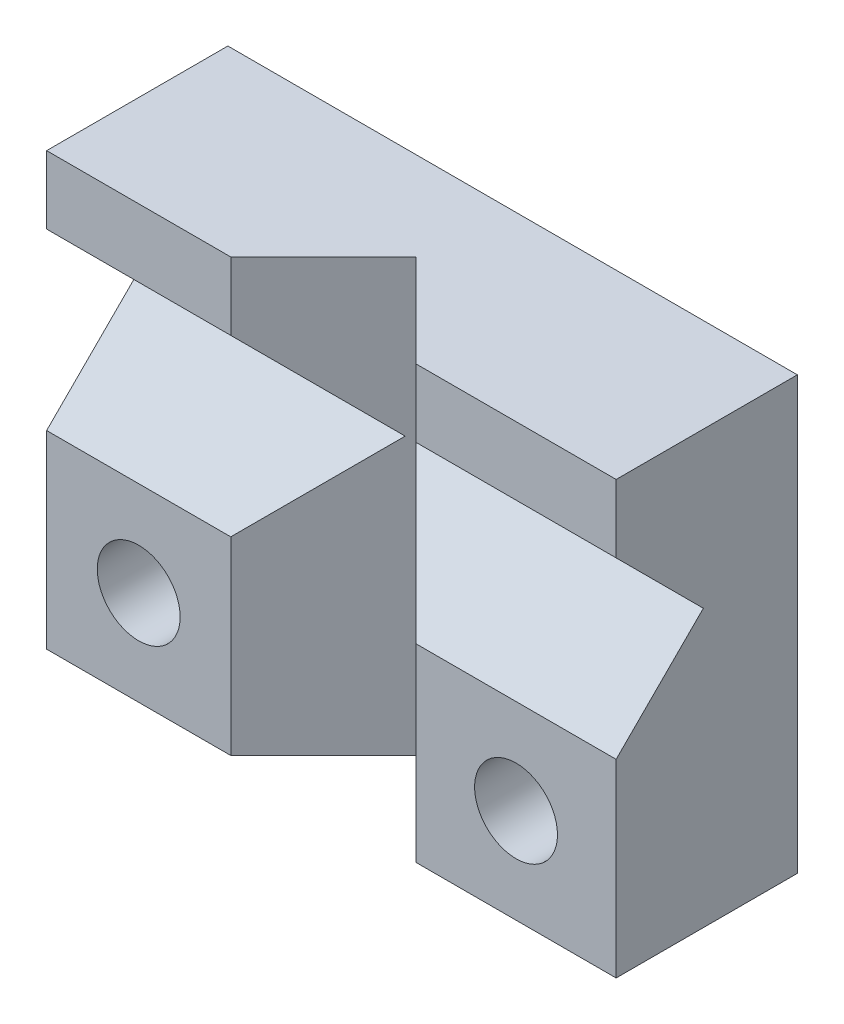
ISO-10303-21;
HEADER;
FILE_DESCRIPTION(('STEP AP214'),'2;1');
FILE_NAME('part.step','',(''),(''),'','','');
FILE_SCHEMA(('AUTOMOTIVE_DESIGN { 1 0 10303 214 1 1 1 1 }'));
ENDSEC;
DATA;
#1=APPLICATION_CONTEXT('core data for automotive mechanical design processes');
#2=APPLICATION_PROTOCOL_DEFINITION('international standard','automotive_design',2000,#1);
#3=PRODUCT_CONTEXT('',#1,'mechanical');
#4=PRODUCT('Part','Part','',(#3));
#5=PRODUCT_RELATED_PRODUCT_CATEGORY('part','',(#4));
#6=PRODUCT_DEFINITION_FORMATION('','',#4);
#7=PRODUCT_DEFINITION_CONTEXT('part definition',#1,'design');
#8=PRODUCT_DEFINITION('design','',#6,#7);
#9=PRODUCT_DEFINITION_SHAPE('','',#8);
#10=(LENGTH_UNIT() NAMED_UNIT(*) SI_UNIT(.MILLI.,.METRE.));
#11=(NAMED_UNIT(*) PLANE_ANGLE_UNIT() SI_UNIT($,.RADIAN.));
#12=(NAMED_UNIT(*) SI_UNIT($,.STERADIAN.) SOLID_ANGLE_UNIT());
#13=UNCERTAINTY_MEASURE_WITH_UNIT(LENGTH_MEASURE(1.E-05),#10,'distance_accuracy_value','');
#14=(GEOMETRIC_REPRESENTATION_CONTEXT(3) GLOBAL_UNCERTAINTY_ASSIGNED_CONTEXT((#13)) GLOBAL_UNIT_ASSIGNED_CONTEXT((#10,
#11,#12)) REPRESENTATION_CONTEXT('',''));
#15=CARTESIAN_POINT('',(0.,0.,0.));
#16=DIRECTION('',(0.,0.,1.));
#17=DIRECTION('',(1.,0.,0.));
#18=AXIS2_PLACEMENT_3D('',#15,#16,#17);
#19=CARTESIAN_POINT('',(0.,0.,4.));
#20=DIRECTION('',(0.,0.,1.));
#21=DIRECTION('',(1.,0.,0.));
#22=AXIS2_PLACEMENT_3D('',#19,#20,#21);
#23=PLANE('',#22);
#24=DIRECTION('',(0.,1.,0.));
#25=VECTOR('',#24,1.);
#26=CARTESIAN_POINT('',(-2.22099999999996,-4.76600000000002,4.));
#27=LINE('',#26,#25);
#28=CARTESIAN_POINT('',(-2.22099999999996,3.26499999999999,4.));
#29=VERTEX_POINT('',#28);
#30=CARTESIAN_POINT('',(-2.22099999999996,4.76499999999999,4.));
#31=VERTEX_POINT('',#30);
#32=EDGE_CURVE('E236',#29,#31,#27,.T.);
#33=ORIENTED_EDGE('',*,*,#32,.T.);
#34=DIRECTION('',(-1.,0.,0.));
#35=VECTOR('',#34,1.);
#36=CARTESIAN_POINT('',(-6.28499999999996,4.76499999999999,4.));
#37=LINE('',#36,#35);
#38=CARTESIAN_POINT('',(-6.28499999999996,4.76499999999999,4.));
#39=VERTEX_POINT('',#38);
#40=EDGE_CURVE('E163',#31,#39,#37,.T.);
#41=ORIENTED_EDGE('',*,*,#40,.T.);
#42=DIRECTION('',(0.,-1.,0.));
#43=VECTOR('',#42,1.);
#44=CARTESIAN_POINT('',(-6.28499999999996,4.76499999999999,4.));
#45=LINE('',#44,#43);
#46=CARTESIAN_POINT('',(-6.28499999999996,3.26499999999999,4.));
#47=VERTEX_POINT('',#46);
#48=EDGE_CURVE('E169',#39,#47,#45,.T.);
#49=ORIENTED_EDGE('',*,*,#48,.T.);
#50=DIRECTION('',(-1.,0.,0.));
#51=VECTOR('',#50,1.);
#52=CARTESIAN_POINT('',(6.28600000000007,3.26499999999999,4.));
#53=LINE('',#52,#51);
#54=EDGE_CURVE('E226',#29,#47,#53,.T.);
#55=ORIENTED_EDGE('',*,*,#54,.F.);
#56=EDGE_LOOP('',(#33,#41,#49,#55));
#57=FACE_BOUND('',#56,.T.);
#58=ADVANCED_FACE('F35',(#57),#23,.T.);
#59=CARTESIAN_POINT('',(-4.25299999999996,-2.67500000000002,4.));
#60=DIRECTION('',(0.,0.,1.));
#61=DIRECTION('',(1.,0.,0.));
#62=AXIS2_PLACEMENT_3D('',#59,#60,#61);
#63=CIRCLE('',#62,0.914399999999999);
#64=CARTESIAN_POINT('',(-3.33859999999996,-2.67500000000002,4.));
#65=VERTEX_POINT('',#64);
#66=EDGE_CURVE('E410',#65,#65,#63,.T.);
#67=ORIENTED_EDGE('',*,*,#66,.F.);
#68=EDGE_LOOP('',(#67));
#69=FACE_BOUND('',#68,.T.);
#70=CARTESIAN_POINT('',(-2.22099999999996,-4.76500000000002,4.));
#71=VERTEX_POINT('',#70);
#72=CARTESIAN_POINT('',(-2.22099999999996,-0.58500000000002,4.));
#73=VERTEX_POINT('',#72);
#74=EDGE_CURVE('E136',#71,#73,#27,.T.);
#75=ORIENTED_EDGE('',*,*,#74,.T.);
#76=DIRECTION('',(-1.,0.,0.));
#77=VECTOR('',#76,1.);
#78=CARTESIAN_POINT('',(6.28600000000007,-0.58500000000002,4.));
#79=LINE('',#78,#77);
#80=CARTESIAN_POINT('',(-6.28499999999996,-0.58500000000002,4.));
#81=VERTEX_POINT('',#80);
#82=EDGE_CURVE('E58',#73,#81,#79,.T.);
#83=ORIENTED_EDGE('',*,*,#82,.T.);
#84=CARTESIAN_POINT('',(-6.28499999999996,-4.76500000000002,4.));
#85=VERTEX_POINT('',#84);
#86=EDGE_CURVE('E168',#81,#85,#45,.T.);
#87=ORIENTED_EDGE('',*,*,#86,.T.);
#88=DIRECTION('',(1.,0.,0.));
#89=VECTOR('',#88,1.);
#90=CARTESIAN_POINT('',(-6.28499999999996,-4.76500000000002,4.));
#91=LINE('',#90,#89);
#92=EDGE_CURVE('E173',#85,#71,#91,.T.);
#93=ORIENTED_EDGE('',*,*,#92,.T.);
#94=EDGE_LOOP('',(#75,#83,#87,#93));
#95=FACE_BOUND('',#94,.T.);
#96=ADVANCED_FACE('F259',(#69,#95),#23,.T.);
#97=CARTESIAN_POINT('',(6.28600000000007,3.26499999999999,4.));
#98=DIRECTION('',(0.,0.707106781186547,-0.707106781186547));
#99=DIRECTION('',(0.,0.707106781186548,0.707106781186548));
#100=AXIS2_PLACEMENT_3D('',#97,#98,#99);
#101=PLANE('',#100);
#102=DIRECTION('',(-1.,0.,0.));
#103=VECTOR('',#102,1.);
#104=CARTESIAN_POINT('',(6.28600000000007,1.33999999999999,2.07499999999999));
#105=LINE('',#104,#103);
#106=CARTESIAN_POINT('',(-0.295999999999952,1.33999999999999,2.075));
#107=VERTEX_POINT('',#106);
#108=CARTESIAN_POINT('',(-6.28499999999996,1.33999999999999,2.07499999999999));
#109=VERTEX_POINT('',#108);
#110=EDGE_CURVE('E151',#107,#109,#105,.T.);
#111=ORIENTED_EDGE('',*,*,#110,.F.);
#112=DIRECTION('',(0.577350269189626,-0.577350269189626,-0.577350269189626));
#113=VECTOR('',#112,1.);
#114=CARTESIAN_POINT('',(0.456000000000048,0.58799999999999,1.323));
#115=LINE('',#114,#113);
#116=EDGE_CURVE('E232',#29,#107,#115,.T.);
#117=ORIENTED_EDGE('',*,*,#116,.F.);
#118=ORIENTED_EDGE('',*,*,#54,.T.);
#119=DIRECTION('',(0.,-0.707106781186547,-0.707106781186548));
#120=VECTOR('',#119,1.);
#121=CARTESIAN_POINT('',(-6.28499999999996,3.26499999999999,4.));
#122=LINE('',#121,#120);
#123=EDGE_CURVE('E221',#47,#109,#122,.T.);
#124=ORIENTED_EDGE('',*,*,#123,.T.);
#125=EDGE_LOOP('',(#111,#117,#118,#124));
#126=FACE_BOUND('',#125,.T.);
#127=ADVANCED_FACE('F231',(#126),#101,.F.);
#128=CARTESIAN_POINT('',(6.28600000000007,1.33999999999999,2.07499999999999));
#129=DIRECTION('',(0.,-0.707106781186547,-0.707106781186547));
#130=DIRECTION('',(0.,0.707106781186548,-0.707106781186548));
#131=AXIS2_PLACEMENT_3D('',#128,#129,#130);
#132=PLANE('',#131);
#133=ORIENTED_EDGE('',*,*,#82,.F.);
#134=DIRECTION('',(-0.577350269189626,-0.577350269189626,0.577350269189626));
#135=VECTOR('',#134,1.);
#136=CARTESIAN_POINT('',(-3.61466666666662,-1.97866666666669,5.39366666666667));
#137=LINE('',#136,#135);
#138=EDGE_CURVE('E400',#107,#73,#137,.T.);
#139=ORIENTED_EDGE('',*,*,#138,.F.);
#140=ORIENTED_EDGE('',*,*,#110,.T.);
#141=DIRECTION('',(0.,-0.707106781186547,0.707106781186548));
#142=VECTOR('',#141,1.);
#143=CARTESIAN_POINT('',(-6.28499999999996,1.33999999999999,2.07499999999999));
#144=LINE('',#143,#142);
#145=EDGE_CURVE('E155',#109,#81,#144,.T.);
#146=ORIENTED_EDGE('',*,*,#145,.T.);
#147=EDGE_LOOP('',(#133,#139,#140,#146));
#148=FACE_BOUND('',#147,.T.);
#149=ADVANCED_FACE('F257',(#148),#132,.F.);
#150=DIRECTION('',(0.,1.,0.));
#151=VECTOR('',#150,1.);
#152=CARTESIAN_POINT('',(1.86631269327047,-4.76600000000002,4.));
#153=LINE('',#152,#151);
#154=CARTESIAN_POINT('',(1.86631269327047,3.26499999999999,4.));
#155=VERTEX_POINT('',#154);
#156=CARTESIAN_POINT('',(1.86631269327047,4.76499999999999,4.));
#157=VERTEX_POINT('',#156);
#158=EDGE_CURVE('E245',#155,#157,#153,.T.);
#159=ORIENTED_EDGE('',*,*,#158,.F.);
#160=CARTESIAN_POINT('',(6.28500000000007,3.26499999999999,4.));
#161=VERTEX_POINT('',#160);
#162=EDGE_CURVE('E144',#161,#155,#53,.T.);
#163=ORIENTED_EDGE('',*,*,#162,.F.);
#164=DIRECTION('',(0.,1.,0.));
#165=VECTOR('',#164,1.);
#166=CARTESIAN_POINT('',(6.28500000000007,4.76499999999999,4.));
#167=LINE('',#166,#165);
#168=CARTESIAN_POINT('',(6.28500000000007,4.76499999999999,4.));
#169=VERTEX_POINT('',#168);
#170=EDGE_CURVE('E164',#161,#169,#167,.T.);
#171=ORIENTED_EDGE('',*,*,#170,.T.);
#172=EDGE_CURVE('E165',#169,#157,#37,.T.);
#173=ORIENTED_EDGE('',*,*,#172,.T.);
#174=EDGE_LOOP('',(#159,#163,#171,#173));
#175=FACE_BOUND('',#174,.T.);
#176=ADVANCED_FACE('F255',(#175),#23,.T.);
#177=CARTESIAN_POINT('',(6.28500000000007,4.76499999999999,4.));
#178=DIRECTION('',(-1.,0.,0.));
#179=DIRECTION('',(0.,0.,1.));
#180=AXIS2_PLACEMENT_3D('',#177,#178,#179);
#181=PLANE('',#180);
#182=ORIENTED_EDGE('',*,*,#170,.F.);
#183=DIRECTION('',(0.,0.707106781186548,0.707106781186548));
#184=VECTOR('',#183,1.);
#185=CARTESIAN_POINT('',(6.28500000000007,3.26499999999999,4.));
#186=LINE('',#185,#184);
#187=CARTESIAN_POINT('',(6.28500000000007,1.33999999999999,2.07499999999999));
#188=VERTEX_POINT('',#187);
#189=EDGE_CURVE('E219',#188,#161,#186,.T.);
#190=ORIENTED_EDGE('',*,*,#189,.F.);
#191=DIRECTION('',(0.,0.707106781186548,-0.707106781186548));
#192=VECTOR('',#191,1.);
#193=CARTESIAN_POINT('',(6.28500000000007,1.33999999999999,2.07499999999999));
#194=LINE('',#193,#192);
#195=CARTESIAN_POINT('',(6.28500000000007,-0.58500000000002,4.));
#196=VERTEX_POINT('',#195);
#197=EDGE_CURVE('E149',#196,#188,#194,.T.);
#198=ORIENTED_EDGE('',*,*,#197,.F.);
#199=CARTESIAN_POINT('',(6.28500000000007,-4.76500000000002,4.));
#200=VERTEX_POINT('',#199);
#201=EDGE_CURVE('E160',#200,#196,#167,.T.);
#202=ORIENTED_EDGE('',*,*,#201,.F.);
#203=DIRECTION('',(0.,0.,-1.));
#204=VECTOR('',#203,1.);
#205=CARTESIAN_POINT('',(6.28500000000007,-4.76500000000002,4.));
#206=LINE('',#205,#204);
#207=CARTESIAN_POINT('',(6.28500000000007,-4.76500000000002,0.));
#208=VERTEX_POINT('',#207);
#209=EDGE_CURVE('E176',#200,#208,#206,.T.);
#210=ORIENTED_EDGE('',*,*,#209,.T.);
#211=DIRECTION('',(0.,1.,0.));
#212=VECTOR('',#211,1.);
#213=CARTESIAN_POINT('',(6.28500000000007,4.76499999999999,0.));
#214=LINE('',#213,#212);
#215=CARTESIAN_POINT('',(6.28500000000007,4.76499999999999,0.));
#216=VERTEX_POINT('',#215);
#217=EDGE_CURVE('E159',#208,#216,#214,.T.);
#218=ORIENTED_EDGE('',*,*,#217,.T.);
#219=DIRECTION('',(0.,0.,-1.));
#220=VECTOR('',#219,1.);
#221=CARTESIAN_POINT('',(6.28500000000007,4.76499999999999,4.));
#222=LINE('',#221,#220);
#223=EDGE_CURVE('E11',#169,#216,#222,.T.);
#224=ORIENTED_EDGE('',*,*,#223,.F.);
#225=EDGE_LOOP('',(#182,#190,#198,#202,#210,#218,#224));
#226=FACE_BOUND('',#225,.T.);
#227=ADVANCED_FACE('F37',(#226),#181,.F.);
#228=CARTESIAN_POINT('',(-6.28499999999996,4.76499999999999,4.));
#229=DIRECTION('',(0.,-1.,0.));
#230=DIRECTION('',(0.,0.,-1.));
#231=AXIS2_PLACEMENT_3D('',#228,#229,#230);
#232=PLANE('',#231);
#233=ORIENTED_EDGE('',*,*,#40,.F.);
#234=DIRECTION('',(-0.707106781186547,0.,0.707106781186547));
#235=VECTOR('',#234,1.);
#236=CARTESIAN_POINT('',(-2.22099999999996,4.76499999999999,4.));
#237=LINE('',#236,#235);
#238=CARTESIAN_POINT('',(-0.177343653364743,4.76499999999999,1.95634365336479));
#239=VERTEX_POINT('',#238);
#240=EDGE_CURVE('E240',#239,#31,#237,.T.);
#241=ORIENTED_EDGE('',*,*,#240,.F.);
#242=DIRECTION('',(-0.707106781186548,0.,-0.707106781186548));
#243=VECTOR('',#242,1.);
#244=CARTESIAN_POINT('',(-0.177343653364743,4.76499999999999,1.95634365336479));
#245=LINE('',#244,#243);
#246=EDGE_CURVE('E243',#157,#239,#245,.T.);
#247=ORIENTED_EDGE('',*,*,#246,.F.);
#248=ORIENTED_EDGE('',*,*,#172,.F.);
#249=ORIENTED_EDGE('',*,*,#223,.T.);
#250=DIRECTION('',(-1.,0.,0.));
#251=VECTOR('',#250,1.);
#252=CARTESIAN_POINT('',(-6.28499999999996,4.76499999999999,0.));
#253=LINE('',#252,#251);
#254=CARTESIAN_POINT('',(-6.28499999999996,4.76499999999999,0.));
#255=VERTEX_POINT('',#254);
#256=EDGE_CURVE('E179',#216,#255,#253,.T.);
#257=ORIENTED_EDGE('',*,*,#256,.T.);
#258=DIRECTION('',(0.,0.,-1.));
#259=VECTOR('',#258,1.);
#260=CARTESIAN_POINT('',(-6.28499999999996,4.76499999999999,4.));
#261=LINE('',#260,#259);
#262=EDGE_CURVE('E43',#39,#255,#261,.T.);
#263=ORIENTED_EDGE('',*,*,#262,.F.);
#264=EDGE_LOOP('',(#233,#241,#247,#248,#249,#257,#263));
#265=FACE_BOUND('',#264,.T.);
#266=ADVANCED_FACE('F238',(#265),#232,.F.);
#267=CARTESIAN_POINT('',(-6.28499999999996,4.76499999999999,4.));
#268=DIRECTION('',(1.,0.,0.));
#269=DIRECTION('',(0.,0.,-1.));
#270=AXIS2_PLACEMENT_3D('',#267,#268,#269);
#271=PLANE('',#270);
#272=ORIENTED_EDGE('',*,*,#145,.F.);
#273=ORIENTED_EDGE('',*,*,#123,.F.);
#274=ORIENTED_EDGE('',*,*,#48,.F.);
#275=ORIENTED_EDGE('',*,*,#262,.T.);
#276=DIRECTION('',(0.,-1.,0.));
#277=VECTOR('',#276,1.);
#278=CARTESIAN_POINT('',(-6.28499999999996,4.76499999999999,0.));
#279=LINE('',#278,#277);
#280=CARTESIAN_POINT('',(-6.28499999999996,-4.76500000000002,0.));
#281=VERTEX_POINT('',#280);
#282=EDGE_CURVE('E181',#255,#281,#279,.T.);
#283=ORIENTED_EDGE('',*,*,#282,.T.);
#284=DIRECTION('',(0.,0.,-1.));
#285=VECTOR('',#284,1.);
#286=CARTESIAN_POINT('',(-6.28499999999996,-4.76500000000002,4.));
#287=LINE('',#286,#285);
#288=EDGE_CURVE('E187',#85,#281,#287,.T.);
#289=ORIENTED_EDGE('',*,*,#288,.F.);
#290=ORIENTED_EDGE('',*,*,#86,.F.);
#291=EDGE_LOOP('',(#272,#273,#274,#275,#283,#289,#290));
#292=FACE_BOUND('',#291,.T.);
#293=ADVANCED_FACE('F195',(#292),#271,.F.);
#294=CARTESIAN_POINT('',(-6.28499999999996,-4.76500000000002,4.));
#295=DIRECTION('',(0.,1.,0.));
#296=DIRECTION('',(0.,0.,1.));
#297=AXIS2_PLACEMENT_3D('',#294,#295,#296);
#298=PLANE('',#297);
#299=DIRECTION('',(0.707106781186548,0.,0.707106781186548));
#300=VECTOR('',#299,1.);
#301=CARTESIAN_POINT('',(-0.177343653364743,-4.76500000000002,1.95634365336479));
#302=LINE('',#301,#300);
#303=CARTESIAN_POINT('',(-0.177343653364743,-4.76500000000002,1.95634365336479));
#304=VERTEX_POINT('',#303);
#305=CARTESIAN_POINT('',(1.86631269327047,-4.76500000000002,4.));
#306=VERTEX_POINT('',#305);
#307=EDGE_CURVE('E145',#304,#306,#302,.T.);
#308=ORIENTED_EDGE('',*,*,#307,.F.);
#309=DIRECTION('',(0.707106781186548,0.,-0.707106781186548));
#310=VECTOR('',#309,1.);
#311=CARTESIAN_POINT('',(-2.22099999999996,-4.76500000000002,4.));
#312=LINE('',#311,#310);
#313=EDGE_CURVE('E218',#71,#304,#312,.T.);
#314=ORIENTED_EDGE('',*,*,#313,.F.);
#315=ORIENTED_EDGE('',*,*,#92,.F.);
#316=ORIENTED_EDGE('',*,*,#288,.T.);
#317=DIRECTION('',(1.,0.,0.));
#318=VECTOR('',#317,1.);
#319=CARTESIAN_POINT('',(-6.28499999999996,-4.76500000000002,0.));
#320=LINE('',#319,#318);
#321=EDGE_CURVE('E183',#281,#208,#320,.T.);
#322=ORIENTED_EDGE('',*,*,#321,.T.);
#323=ORIENTED_EDGE('',*,*,#209,.F.);
#324=EDGE_CURVE('E172',#306,#200,#91,.T.);
#325=ORIENTED_EDGE('',*,*,#324,.F.);
#326=EDGE_LOOP('',(#308,#314,#315,#316,#322,#323,#325));
#327=FACE_BOUND('',#326,.T.);
#328=ADVANCED_FACE('F207',(#327),#298,.F.);
#329=CARTESIAN_POINT('',(4.07565634663527,-2.67500000000002,4.));
#330=DIRECTION('',(0.,0.,1.));
#331=DIRECTION('',(1.,0.,0.));
#332=AXIS2_PLACEMENT_3D('',#329,#330,#331);
#333=CIRCLE('',#332,0.914399999999999);
#334=CARTESIAN_POINT('',(4.99005634663527,-2.67500000000002,4.));
#335=VERTEX_POINT('',#334);
#336=EDGE_CURVE('E401',#335,#335,#333,.T.);
#337=ORIENTED_EDGE('',*,*,#336,.F.);
#338=EDGE_LOOP('',(#337));
#339=FACE_BOUND('',#338,.T.);
#340=CARTESIAN_POINT('',(1.86631269327047,-0.58500000000002,4.));
#341=VERTEX_POINT('',#340);
#342=EDGE_CURVE('E50',#306,#341,#153,.T.);
#343=ORIENTED_EDGE('',*,*,#342,.F.);
#344=ORIENTED_EDGE('',*,*,#324,.T.);
#345=ORIENTED_EDGE('',*,*,#201,.T.);
#346=EDGE_CURVE('E153',#196,#341,#79,.T.);
#347=ORIENTED_EDGE('',*,*,#346,.T.);
#348=EDGE_LOOP('',(#343,#344,#345,#347));
#349=FACE_BOUND('',#348,.T.);
#350=ADVANCED_FACE('F215',(#339,#349),#23,.T.);
#351=CARTESIAN_POINT('',(0.,0.,0.));
#352=DIRECTION('',(0.,0.,1.));
#353=DIRECTION('',(1.,0.,0.));
#354=AXIS2_PLACEMENT_3D('',#351,#352,#353);
#355=PLANE('',#354);
#356=CARTESIAN_POINT('',(-4.25299999999996,-2.67500000000002,0.));
#357=DIRECTION('',(0.,0.,1.));
#358=DIRECTION('',(1.,0.,0.));
#359=AXIS2_PLACEMENT_3D('',#356,#357,#358);
#360=CIRCLE('',#359,0.914399999999999);
#361=CARTESIAN_POINT('',(-3.33859999999996,-2.67500000000002,0.));
#362=VERTEX_POINT('',#361);
#363=EDGE_CURVE('E396',#362,#362,#360,.T.);
#364=ORIENTED_EDGE('',*,*,#363,.T.);
#365=EDGE_LOOP('',(#364));
#366=FACE_BOUND('',#365,.T.);
#367=CARTESIAN_POINT('',(4.07565634663527,-2.67500000000002,0.));
#368=DIRECTION('',(0.,0.,1.));
#369=DIRECTION('',(1.,0.,0.));
#370=AXIS2_PLACEMENT_3D('',#367,#368,#369);
#371=CIRCLE('',#370,0.914399999999999);
#372=CARTESIAN_POINT('',(4.99005634663527,-2.67500000000002,0.));
#373=VERTEX_POINT('',#372);
#374=EDGE_CURVE('E399',#373,#373,#371,.T.);
#375=ORIENTED_EDGE('',*,*,#374,.T.);
#376=EDGE_LOOP('',(#375));
#377=FACE_BOUND('',#376,.T.);
#378=ORIENTED_EDGE('',*,*,#217,.F.);
#379=ORIENTED_EDGE('',*,*,#321,.F.);
#380=ORIENTED_EDGE('',*,*,#282,.F.);
#381=ORIENTED_EDGE('',*,*,#256,.F.);
#382=EDGE_LOOP('',(#378,#379,#380,#381));
#383=FACE_BOUND('',#382,.T.);
#384=ADVANCED_FACE('F203',(#366,#377,#383),#355,.F.);
#385=ORIENTED_EDGE('',*,*,#162,.T.);
#386=DIRECTION('',(0.577350269189626,0.577350269189626,0.577350269189626));
#387=VECTOR('',#386,1.);
#388=CARTESIAN_POINT('',(-2.17312487115301,-0.774437564423487,-0.0394375644234796));
#389=LINE('',#388,#387);
#390=CARTESIAN_POINT('',(-0.0586873067295356,1.33999999999999,2.07499999999999));
#391=VERTEX_POINT('',#390);
#392=EDGE_CURVE('E131',#391,#155,#389,.T.);
#393=ORIENTED_EDGE('',*,*,#392,.F.);
#394=EDGE_CURVE('E141',#188,#391,#105,.T.);
#395=ORIENTED_EDGE('',*,*,#394,.F.);
#396=ORIENTED_EDGE('',*,*,#189,.T.);
#397=EDGE_LOOP('',(#385,#393,#395,#396));
#398=FACE_BOUND('',#397,.T.);
#399=ADVANCED_FACE('F140',(#398),#101,.F.);
#400=ORIENTED_EDGE('',*,*,#394,.T.);
#401=DIRECTION('',(-0.577350269189626,0.577350269189626,-0.577350269189626));
#402=VECTOR('',#401,1.);
#403=CARTESIAN_POINT('',(1.89754179551366,-0.616229102243211,4.03122910224319));
#404=LINE('',#403,#402);
#405=EDGE_CURVE('E128',#341,#391,#404,.T.);
#406=ORIENTED_EDGE('',*,*,#405,.F.);
#407=ORIENTED_EDGE('',*,*,#346,.F.);
#408=ORIENTED_EDGE('',*,*,#197,.T.);
#409=EDGE_LOOP('',(#400,#406,#407,#408));
#410=FACE_BOUND('',#409,.T.);
#411=ADVANCED_FACE('F147',(#410),#132,.F.);
#412=CARTESIAN_POINT('',(-2.22099999999996,-4.76600000000002,4.));
#413=DIRECTION('',(-0.707106781186547,0.,-0.707106781186547));
#414=DIRECTION('',(-0.707106781186548,0.,0.707106781186548));
#415=AXIS2_PLACEMENT_3D('',#412,#413,#414);
#416=PLANE('',#415);
#417=ORIENTED_EDGE('',*,*,#313,.T.);
#418=DIRECTION('',(0.,1.,0.));
#419=VECTOR('',#418,1.);
#420=CARTESIAN_POINT('',(-0.177343653364743,-4.76600000000002,1.95634365336479));
#421=LINE('',#420,#419);
#422=EDGE_CURVE('E252',#304,#239,#421,.T.);
#423=ORIENTED_EDGE('',*,*,#422,.T.);
#424=ORIENTED_EDGE('',*,*,#240,.T.);
#425=ORIENTED_EDGE('',*,*,#32,.F.);
#426=ORIENTED_EDGE('',*,*,#116,.T.);
#427=ORIENTED_EDGE('',*,*,#138,.T.);
#428=ORIENTED_EDGE('',*,*,#74,.F.);
#429=EDGE_LOOP('',(#417,#423,#424,#425,#426,#427,#428));
#430=FACE_BOUND('',#429,.T.);
#431=ADVANCED_FACE('F253',(#430),#416,.F.);
#432=CARTESIAN_POINT('',(-0.177343653364743,-4.76600000000002,1.95634365336479));
#433=DIRECTION('',(0.707106781186547,0.,-0.707106781186547));
#434=DIRECTION('',(-0.707106781186548,0.,-0.707106781186548));
#435=AXIS2_PLACEMENT_3D('',#432,#433,#434);
#436=PLANE('',#435);
#437=ORIENTED_EDGE('',*,*,#307,.T.);
#438=ORIENTED_EDGE('',*,*,#342,.T.);
#439=ORIENTED_EDGE('',*,*,#405,.T.);
#440=ORIENTED_EDGE('',*,*,#392,.T.);
#441=ORIENTED_EDGE('',*,*,#158,.T.);
#442=ORIENTED_EDGE('',*,*,#246,.T.);
#443=ORIENTED_EDGE('',*,*,#422,.F.);
#444=EDGE_LOOP('',(#437,#438,#439,#440,#441,#442,#443));
#445=FACE_BOUND('',#444,.T.);
#446=ADVANCED_FACE('F130',(#445),#436,.F.);
#447=CARTESIAN_POINT('',(4.07565634663527,-2.67500000000002,4.));
#448=DIRECTION('',(0.,0.,1.));
#449=DIRECTION('',(1.,0.,0.));
#450=AXIS2_PLACEMENT_3D('',#447,#448,#449);
#451=CYLINDRICAL_SURFACE('',#450,0.914399999999999);
#452=ORIENTED_EDGE('',*,*,#374,.F.);
#453=EDGE_LOOP('',(#452));
#454=FACE_BOUND('',#453,.T.);
#455=ORIENTED_EDGE('',*,*,#336,.T.);
#456=EDGE_LOOP('',(#455));
#457=FACE_BOUND('',#456,.T.);
#458=ADVANCED_FACE('F345',(#454,#457),#451,.F.);
#459=CARTESIAN_POINT('',(-4.25299999999996,-2.67500000000002,4.));
#460=DIRECTION('',(0.,0.,1.));
#461=DIRECTION('',(1.,0.,0.));
#462=AXIS2_PLACEMENT_3D('',#459,#460,#461);
#463=CYLINDRICAL_SURFACE('',#462,0.914399999999999);
#464=ORIENTED_EDGE('',*,*,#363,.F.);
#465=EDGE_LOOP('',(#464));
#466=FACE_BOUND('',#465,.T.);
#467=ORIENTED_EDGE('',*,*,#66,.T.);
#468=EDGE_LOOP('',(#467));
#469=FACE_BOUND('',#468,.T.);
#470=ADVANCED_FACE('F355',(#466,#469),#463,.F.);
#471=CLOSED_SHELL('',(#58,#96,#127,#149,#176,#227,#266,#293,#328,#350,#384,#399,#411,#431,#446,
#458,#470));
#472=MANIFOLD_SOLID_BREP('B2',#471);
#473=ADVANCED_BREP_SHAPE_REPRESENTATION('',(#18,#472),#14);
#474=SHAPE_DEFINITION_REPRESENTATION(#9,#473);
ENDSEC;
END-ISO-10303-21;
